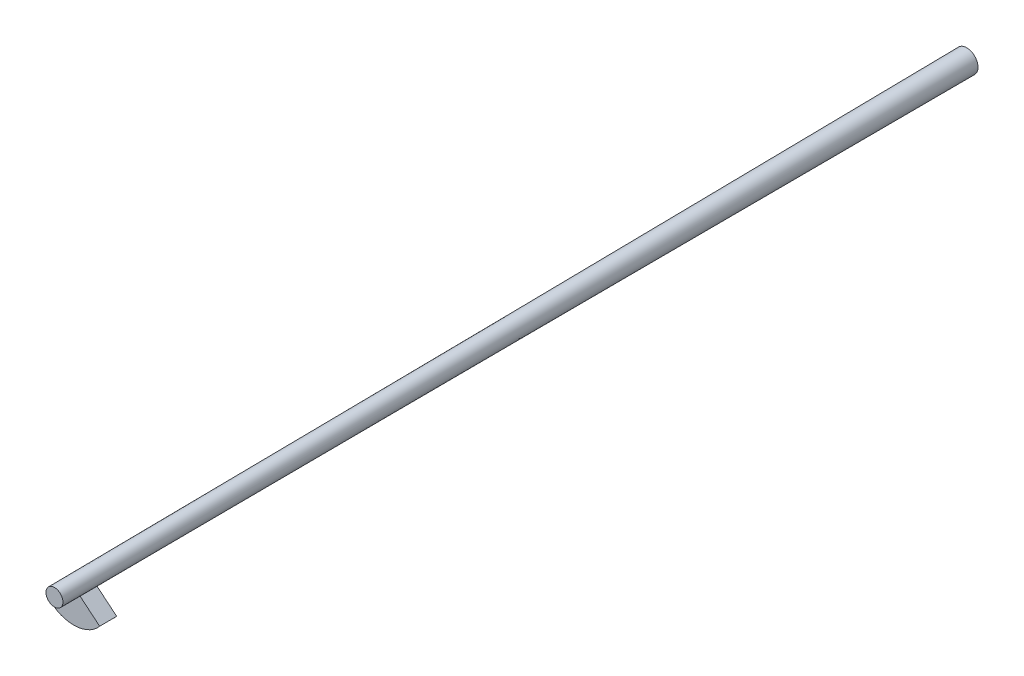
ISO-10303-21;
HEADER;
FILE_DESCRIPTION(('STEP AP214'),'2;1');
FILE_NAME('part.step','',(''),(''),'','','');
FILE_SCHEMA(('AUTOMOTIVE_DESIGN { 1 0 10303 214 1 1 1 1 }'));
ENDSEC;
DATA;
#1=APPLICATION_CONTEXT('core data for automotive mechanical design processes');
#2=APPLICATION_PROTOCOL_DEFINITION('international standard','automotive_design',2000,#1);
#3=PRODUCT_CONTEXT('',#1,'mechanical');
#4=PRODUCT('Part','Part','',(#3));
#5=PRODUCT_RELATED_PRODUCT_CATEGORY('part','',(#4));
#6=PRODUCT_DEFINITION_FORMATION('','',#4);
#7=PRODUCT_DEFINITION_CONTEXT('part definition',#1,'design');
#8=PRODUCT_DEFINITION('design','',#6,#7);
#9=PRODUCT_DEFINITION_SHAPE('','',#8);
#10=(LENGTH_UNIT() NAMED_UNIT(*) SI_UNIT(.MILLI.,.METRE.));
#11=(NAMED_UNIT(*) PLANE_ANGLE_UNIT() SI_UNIT($,.RADIAN.));
#12=(NAMED_UNIT(*) SI_UNIT($,.STERADIAN.) SOLID_ANGLE_UNIT());
#13=UNCERTAINTY_MEASURE_WITH_UNIT(LENGTH_MEASURE(1.E-05),#10,'distance_accuracy_value','');
#14=(GEOMETRIC_REPRESENTATION_CONTEXT(3) GLOBAL_UNCERTAINTY_ASSIGNED_CONTEXT((#13)) GLOBAL_UNIT_ASSIGNED_CONTEXT((#10,
#11,#12)) REPRESENTATION_CONTEXT('',''));
#15=CARTESIAN_POINT('',(0.,0.,0.));
#16=DIRECTION('',(0.,0.,1.));
#17=DIRECTION('',(1.,0.,0.));
#18=AXIS2_PLACEMENT_3D('',#15,#16,#17);
#19=CARTESIAN_POINT('',(0.,3.02083498303412,105.299405924511));
#20=DIRECTION('',(0.,-0.00929846353313626,0.999956768353474));
#21=DIRECTION('',(0.,-0.999956768353474,-0.00929846353313626));
#22=AXIS2_PLACEMENT_3D('',#19,#20,#21);
#23=CONICAL_SURFACE('',#22,1.00686074353616,1.56772788856533);
#24=CARTESIAN_POINT('',(0.,3.02083498303412,105.299405924511));
#25=DIRECTION('',(0.,0.00929846353313626,-0.999956768353474));
#26=DIRECTION('',(0.,0.999956768353474,0.00929846353313626));
#27=AXIS2_PLACEMENT_3D('',#24,#25,#26);
#28=CIRCLE('',#27,1.00686074353616);
#29=CARTESIAN_POINT('',(0.771300077580519,2.37366535182763,105.29338798113));
#30=VERTEX_POINT('',#29);
#31=CARTESIAN_POINT('',(-0.771300077580519,2.37366535182763,105.29338798113));
#32=VERTEX_POINT('',#31);
#33=EDGE_CURVE('E13',#30,#32,#28,.T.);
#34=ORIENTED_EDGE('',*,*,#33,.T.);
#35=DIRECTION('',(-0.766040836847642,-0.642785326745884,-0.00290860824977838));
#36=VECTOR('',#35,1.);
#37=CARTESIAN_POINT('',(-3.06946718952518,0.445271946526975,105.284661987032));
#38=LINE('',#37,#36);
#39=CARTESIAN_POINT('',(-3.06946718952518,0.445271946526975,105.284661987032));
#40=VERTEX_POINT('',#39);
#41=EDGE_CURVE('E117',#32,#40,#38,.T.);
#42=ORIENTED_EDGE('',*,*,#41,.T.);
#43=CARTESIAN_POINT('',(0.,3.02074938622428,105.308611005441));
#44=DIRECTION('',(0.,0.00929846353313626,-0.999956768353474));
#45=DIRECTION('',(0.,0.999956768353474,0.00929846353313626));
#46=AXIS2_PLACEMENT_3D('',#43,#44,#45);
#47=CIRCLE('',#46,4.00690484357242);
#48=CARTESIAN_POINT('',(3.06946718952518,0.445271946526976,105.284661987032));
#49=VERTEX_POINT('',#48);
#50=EDGE_CURVE('E99',#49,#40,#47,.T.);
#51=ORIENTED_EDGE('',*,*,#50,.F.);
#52=DIRECTION('',(0.766040836847642,-0.642785326745884,-0.00290860824977838));
#53=VECTOR('',#52,1.);
#54=CARTESIAN_POINT('',(3.06946718952518,0.445271946526976,105.284661987032));
#55=LINE('',#54,#53);
#56=EDGE_CURVE('E125',#30,#49,#55,.T.);
#57=ORIENTED_EDGE('',*,*,#56,.F.);
#58=EDGE_LOOP('',(#34,#42,#51,#57));
#59=FACE_BOUND('',#58,.T.);
#60=ADVANCED_FACE('F59',(#59),#23,.F.);
#61=CARTESIAN_POINT('',(0.,3.03943182255251,103.299501802703));
#62=DIRECTION('',(0.,0.00929846353313626,-0.999956768353474));
#63=DIRECTION('',(0.,0.999956768353474,0.00929846353313626));
#64=AXIS2_PLACEMENT_3D('',#61,#62,#63);
#65=CONICAL_SURFACE('',#64,1.01299761036521,0.0030684382295755);
#66=CARTESIAN_POINT('',(0.,3.03943182255251,103.299501802703));
#67=DIRECTION('',(0.,0.00929846353313626,-0.999956768353474));
#68=DIRECTION('',(0.,0.999956768353474,0.00929846353313626));
#69=AXIS2_PLACEMENT_3D('',#66,#67,#68);
#70=CIRCLE('',#69,1.01299761036521);
#71=CARTESIAN_POINT('',(0.776001190313077,2.38831765992198,103.293447179654));
#72=VERTEX_POINT('',#71);
#73=CARTESIAN_POINT('',(-0.776001190313077,2.38831765992198,103.293447179654));
#74=VERTEX_POINT('',#73);
#75=EDGE_CURVE('E67',#72,#74,#70,.T.);
#76=ORIENTED_EDGE('',*,*,#75,.T.);
#77=DIRECTION('',(0.0023505563662789,-0.0073261540471719,0.999970400737765));
#78=VECTOR('',#77,1.);
#79=CARTESIAN_POINT('',(-0.771300077580519,2.37366535182763,105.29338798113));
#80=LINE('',#79,#78);
#81=EDGE_CURVE('E123',#74,#32,#80,.T.);
#82=ORIENTED_EDGE('',*,*,#81,.T.);
#83=ORIENTED_EDGE('',*,*,#33,.F.);
#84=DIRECTION('',(-0.0023505563662789,-0.0073261540471719,0.999970400737765));
#85=VECTOR('',#84,1.);
#86=CARTESIAN_POINT('',(0.771300077580519,2.37366535182763,105.29338798113));
#87=LINE('',#86,#85);
#88=EDGE_CURVE('E111',#72,#30,#87,.T.);
#89=ORIENTED_EDGE('',*,*,#88,.F.);
#90=EDGE_LOOP('',(#76,#82,#83,#89));
#91=FACE_BOUND('',#90,.T.);
#92=ADVANCED_FACE('F61',(#91),#65,.F.);
#93=CARTESIAN_POINT('',(0.,3.03934622574268,103.308706883633));
#94=DIRECTION('',(0.,-0.00929846353313626,0.999956768353474));
#95=DIRECTION('',(0.,-0.999956768353474,-0.00929846353313626));
#96=AXIS2_PLACEMENT_3D('',#93,#94,#95);
#97=CONICAL_SURFACE('',#96,4.01304171040147,1.56772788856532);
#98=CARTESIAN_POINT('',(0.,3.03934622574268,103.308706883633));
#99=DIRECTION('',(0.,0.00929846353313626,-0.999956768353474));
#100=DIRECTION('',(0.,0.999956768353474,0.00929846353313626));
#101=AXIS2_PLACEMENT_3D('',#98,#99,#100);
#102=CIRCLE('',#101,4.01304171040147);
#103=CARTESIAN_POINT('',(3.07416830225773,0.459924254621319,103.284721185556));
#104=VERTEX_POINT('',#103);
#105=CARTESIAN_POINT('',(-3.07416830225773,0.459924254621319,103.284721185556));
#106=VERTEX_POINT('',#105);
#107=EDGE_CURVE('E110',#104,#106,#102,.T.);
#108=ORIENTED_EDGE('',*,*,#107,.T.);
#109=DIRECTION('',(0.766040836847642,0.642785326745884,0.00290860824977838));
#110=VECTOR('',#109,1.);
#111=CARTESIAN_POINT('',(-0.776001190313077,2.38831765992198,103.293447179654));
#112=LINE('',#111,#110);
#113=EDGE_CURVE('E118',#106,#74,#112,.T.);
#114=ORIENTED_EDGE('',*,*,#113,.T.);
#115=ORIENTED_EDGE('',*,*,#75,.F.);
#116=DIRECTION('',(-0.766040836847642,0.642785326745884,0.00290860824977838));
#117=VECTOR('',#116,1.);
#118=CARTESIAN_POINT('',(0.776001190313077,2.38831765992198,103.293447179654));
#119=LINE('',#118,#117);
#120=EDGE_CURVE('E128',#104,#72,#119,.T.);
#121=ORIENTED_EDGE('',*,*,#120,.F.);
#122=EDGE_LOOP('',(#108,#114,#115,#121));
#123=FACE_BOUND('',#122,.T.);
#124=ADVANCED_FACE('F131',(#123),#97,.T.);
#125=CARTESIAN_POINT('',(0.,3.02074938622428,105.308611005441));
#126=DIRECTION('',(0.,0.00929846353313626,-0.999956768353474));
#127=DIRECTION('',(0.,0.999956768353474,0.00929846353313626));
#128=AXIS2_PLACEMENT_3D('',#125,#126,#127);
#129=CONICAL_SURFACE('',#128,4.00690484357242,0.003068438229576);
#130=DIRECTION('',(0.0023505563662789,0.0073261540471719,-0.999970400737765));
#131=VECTOR('',#130,1.);
#132=CARTESIAN_POINT('',(3.07416830225773,0.459924254621319,103.284721185556));
#133=LINE('',#132,#131);
#134=EDGE_CURVE('E105',#49,#104,#133,.T.);
#135=ORIENTED_EDGE('',*,*,#134,.F.);
#136=ORIENTED_EDGE('',*,*,#50,.T.);
#137=DIRECTION('',(-0.0023505563662789,0.0073261540471719,-0.999970400737765));
#138=VECTOR('',#137,1.);
#139=CARTESIAN_POINT('',(-3.07416830225773,0.459924254621319,103.284721185556));
#140=LINE('',#139,#138);
#141=EDGE_CURVE('E102',#40,#106,#140,.T.);
#142=ORIENTED_EDGE('',*,*,#141,.T.);
#143=ORIENTED_EDGE('',*,*,#107,.F.);
#144=EDGE_LOOP('',(#135,#136,#142,#143));
#145=FACE_BOUND('',#144,.T.);
#146=ADVANCED_FACE('F101',(#145),#129,.T.);
#147=CARTESIAN_POINT('',(3.06404530302556,1.42872602088599,0.0132855311594383));
#148=DIRECTION('',(-0.642787609686538,-0.766011325756391,-0.0071230363191035));
#149=DIRECTION('',(-0.0071230363191035,-0.00332138278985956,0.999969114908036));
#150=AXIS2_PLACEMENT_3D('',#147,#148,#149);
#151=PLANE('',#150);
#152=ORIENTED_EDGE('',*,*,#56,.T.);
#153=ORIENTED_EDGE('',*,*,#134,.T.);
#154=ORIENTED_EDGE('',*,*,#120,.T.);
#155=ORIENTED_EDGE('',*,*,#88,.T.);
#156=EDGE_LOOP('',(#152,#153,#154,#155));
#157=FACE_BOUND('',#156,.T.);
#158=ADVANCED_FACE('F133',(#157),#151,.F.);
#159=CARTESIAN_POINT('',(-3.06404530302556,1.42872602088599,0.0132855311594383));
#160=DIRECTION('',(-0.642787609686538,0.766011325756391,0.00712303631910351));
#161=DIRECTION('',(0.00712303631910351,-0.00332138278985957,0.999969114908036));
#162=AXIS2_PLACEMENT_3D('',#159,#160,#161);
#163=PLANE('',#162);
#164=ORIENTED_EDGE('',*,*,#41,.F.);
#165=ORIENTED_EDGE('',*,*,#81,.F.);
#166=ORIENTED_EDGE('',*,*,#113,.F.);
#167=ORIENTED_EDGE('',*,*,#141,.F.);
#168=EDGE_LOOP('',(#164,#165,#166,#167));
#169=FACE_BOUND('',#168,.T.);
#170=ADVANCED_FACE('F115',(#169),#163,.T.);
#171=CLOSED_SHELL('',(#60,#92,#124,#146,#158,#170));
#172=MANIFOLD_SOLID_BREP('B2',#171);
#173=CARTESIAN_POINT('',(0.,4.,0.));
#174=DIRECTION('',(0.,0.,1.));
#175=DIRECTION('',(1.,0.,0.));
#176=AXIS2_PLACEMENT_3D('',#173,#174,#175);
#177=PLANE('',#176);
#178=CARTESIAN_POINT('',(0.,4.,0.));
#179=DIRECTION('',(0.,0.,1.));
#180=DIRECTION('',(1.,0.,0.));
#181=AXIS2_PLACEMENT_3D('',#178,#179,#180);
#182=CIRCLE('',#181,1.33);
#183=CARTESIAN_POINT('',(-1.25775116185321,3.56760895608615,0.));
#184=VERTEX_POINT('',#183);
#185=EDGE_CURVE('E58',#184,#184,#182,.T.);
#186=ORIENTED_EDGE('',*,*,#185,.F.);
#187=EDGE_LOOP('',(#186));
#188=FACE_BOUND('',#187,.T.);
#189=ADVANCED_FACE('F195',(#188),#177,.F.);
#190=CARTESIAN_POINT('',(0.,3.,107.54));
#191=DIRECTION('',(0.,0.,1.));
#192=DIRECTION('',(1.,0.,0.));
#193=AXIS2_PLACEMENT_3D('',#190,#191,#192);
#194=PLANE('',#193);
#195=CARTESIAN_POINT('',(0.,3.,107.54));
#196=DIRECTION('',(0.,0.,1.));
#197=DIRECTION('',(1.,0.,0.));
#198=AXIS2_PLACEMENT_3D('',#195,#196,#197);
#199=CIRCLE('',#198,1.);
#200=CARTESIAN_POINT('',(-0.630133871185369,2.22351348731292,107.54));
#201=VERTEX_POINT('',#200);
#202=EDGE_CURVE('E203',#201,#201,#199,.T.);
#203=ORIENTED_EDGE('',*,*,#202,.T.);
#204=EDGE_LOOP('',(#203));
#205=FACE_BOUND('',#204,.T.);
#206=ADVANCED_FACE('F227',(#205),#194,.T.);
#207=CARTESIAN_POINT('',(-0.630133871185369,2.22351348731292,107.54));
#208=CARTESIAN_POINT('',(-1.25775116185321,3.56760895608615,0.));
#209=CARTESIAN_POINT('',(-0.694841080575959,2.27602464324504,107.54));
#210=CARTESIAN_POINT('',(-1.29378374884603,3.67242155290725,0.));
#211=CARTESIAN_POINT('',(-0.76165251927725,2.34329365949734,107.54));
#212=CARTESIAN_POINT('',(-1.32179859947886,3.79536712500961,0.));
#213=CARTESIAN_POINT('',(-0.883036960503424,2.51872720400728,107.54));
#214=CARTESIAN_POINT('',(-1.33522261587105,4.0787827213136,0.));
#215=CARTESIAN_POINT('',(-0.937584486235418,2.62755791195349,107.54));
#216=CARTESIAN_POINT('',(-1.32013393742832,4.23998645453673,0.));
#217=CARTESIAN_POINT('',(-1.00241352288567,2.88622431316963,107.54));
#218=CARTESIAN_POINT('',(-1.21113717423343,4.57748926942496,0.));
#219=CARTESIAN_POINT('',(-1.01156600851155,3.03660780277067,107.54));
#220=CARTESIAN_POINT('',(-1.11556947548108,4.75361141092571,0.));
#221=CARTESIAN_POINT('',(-0.951771480875403,3.34458231090979,107.54));
#222=CARTESIAN_POINT('',(-0.831239342581664,5.0589931863081,0.));
#223=CARTESIAN_POINT('',(-0.881508824551307,3.50071945240419,107.54));
#224=CARTESIAN_POINT('',(-0.642016237556048,5.18568598786757,0.));
#225=CARTESIAN_POINT('',(-0.67146420082285,3.75954828996655,107.54));
#226=CARTESIAN_POINT('',(-0.222765850271646,5.32981633583885,0.));
#227=CARTESIAN_POINT('',(-0.533135829430452,3.8604487830064,107.54));
#228=CARTESIAN_POINT('',(0.00436004522392653,5.34625644039619,0.));
#229=CARTESIAN_POINT('',(-0.24406731419581,3.98236300161444,107.54));
#230=CARTESIAN_POINT('',(0.416362735495832,5.28026071008721,0.));
#231=CARTESIAN_POINT('',(-0.0950207483787361,4.00436489143902,107.54));
#232=CARTESIAN_POINT('',(0.600024498835191,5.2001323726609,0.));
#233=CARTESIAN_POINT('',(0.171451127050833,3.99417417428274,107.54));
#234=CARTESIAN_POINT('',(0.893508107433325,5.0009946918251,0.));
#235=CARTESIAN_POINT('',(0.289180075600346,3.96319918067529,107.54));
#236=CARTESIAN_POINT('',(1.00452994548574,4.88314536727173,0.));
#237=CARTESIAN_POINT('',(0.485844509970799,3.88052989154771,107.54));
#238=CARTESIAN_POINT('',(1.16821330068066,4.65138608768065,0.));
#239=CARTESIAN_POINT('',(0.565426661794779,3.82899766861919,107.54));
#240=CARTESIAN_POINT('',(1.22171857486039,4.53720364073495,0.));
#241=CARTESIAN_POINT('',(0.694841080575959,3.72397535675496,107.54));
#242=CARTESIAN_POINT('',(1.29378374884603,4.32757844709275,0.));
#243=CARTESIAN_POINT('',(0.76165251927725,3.65670634050266,107.54));
#244=CARTESIAN_POINT('',(1.32179859947886,4.20463287499039,0.));
#245=CARTESIAN_POINT('',(0.883036960503424,3.48127279599272,107.54));
#246=CARTESIAN_POINT('',(1.33522261587105,3.9212172786864,0.));
#247=CARTESIAN_POINT('',(0.937584486235417,3.37244208804651,107.54));
#248=CARTESIAN_POINT('',(1.32013393742832,3.76001354546327,0.));
#249=CARTESIAN_POINT('',(1.00241352288567,3.11377568683037,107.54));
#250=CARTESIAN_POINT('',(1.21113717423343,3.42251073057504,0.));
#251=CARTESIAN_POINT('',(1.01156600851155,2.96339219722934,107.54));
#252=CARTESIAN_POINT('',(1.11556947548108,3.24638858907429,0.));
#253=CARTESIAN_POINT('',(0.951771480875403,2.6554176890902,107.54));
#254=CARTESIAN_POINT('',(0.831239342581664,2.9410068136919,0.));
#255=CARTESIAN_POINT('',(0.881508824551307,2.49928054759581,107.54));
#256=CARTESIAN_POINT('',(0.642016237556048,2.81431401213243,0.));
#257=CARTESIAN_POINT('',(0.67146420082285,2.24045171003345,107.54));
#258=CARTESIAN_POINT('',(0.222765850271645,2.67018366416115,0.));
#259=CARTESIAN_POINT('',(0.533135829430452,2.1395512169936,107.54));
#260=CARTESIAN_POINT('',(-0.00436004522392754,2.65374355960381,0.));
#261=CARTESIAN_POINT('',(0.24406731419581,2.01763699838556,107.54));
#262=CARTESIAN_POINT('',(-0.416362735495833,2.71973928991279,0.));
#263=CARTESIAN_POINT('',(0.0950207483787373,1.99563510856098,107.54));
#264=CARTESIAN_POINT('',(-0.600024498835191,2.7998676273391,0.));
#265=CARTESIAN_POINT('',(-0.171451127050832,2.00582582571726,107.54));
#266=CARTESIAN_POINT('',(-0.893508107433325,2.9990053081749,0.));
#267=CARTESIAN_POINT('',(-0.289180075600345,2.03680081932471,107.54));
#268=CARTESIAN_POINT('',(-1.00452994548574,3.11685463272827,0.));
#269=CARTESIAN_POINT('',(-0.485844509970798,2.1194701084523,107.54));
#270=CARTESIAN_POINT('',(-1.16821330068066,3.34861391231935,0.));
#271=CARTESIAN_POINT('',(-0.56542666179478,2.17100233138081,107.54));
#272=CARTESIAN_POINT('',(-1.22171857486039,3.46279635926505,0.));
#273=CARTESIAN_POINT('',(-0.630133871185369,2.22351348731292,107.54));
#274=CARTESIAN_POINT('',(-1.25775116185321,3.56760895608615,0.));
#275=B_SPLINE_SURFACE_WITH_KNOTS('',3,1,((#207,#208),(#209,#210),(#211,#212),(#213,#214),(#215,
#216),(#217,#218),(#219,#220),(#221,#222),(#223,#224),(#225,#226),(#227,#228),(#229,#230),(#231,
#232),(#233,#234),(#235,#236),(#237,#238),(#239,#240),(#241,#242),(#243,#244),(#245,#246),(#247,
#248),(#249,#250),(#251,#252),(#253,#254),(#255,#256),(#257,#258),(#259,#260),(#261,#262),(#263,
#264),(#265,#266),(#267,#268),(#269,#270),(#271,#272),(#273,#274)),.UNSPECIFIED.,.T.,.F.,.F.,(4,
2,2,2,2,2,2,2,2,2,2,2,2,2,2,2,4),(2,2),(0.,0.0625000000000002,0.125,0.1875,0.250000000000001,
0.312500000000001,0.375000000000001,0.4375,0.5,0.5625,0.625,0.6875,0.75,0.8125,0.875,0.9375,1.),
(0.,1.),.UNSPECIFIED.);
#276=CARTESIAN_POINT('',(-0.630133871185369,2.22351348731292,107.54));
#277=CARTESIAN_POINT('',(-0.636671551296493,2.23751448177931,106.419791666667));
#278=CARTESIAN_POINT('',(-0.643209231407616,2.2515154762457,105.299583333333));
#279=CARTESIAN_POINT('',(-0.656284591629863,2.27951746517847,103.059166666667));
#280=CARTESIAN_POINT('',(-0.662822271740986,2.29351845964486,101.938958333333));
#281=CARTESIAN_POINT('',(-0.675897631963233,2.32152044857764,99.6985416666667));
#282=CARTESIAN_POINT('',(-0.682435312074356,2.33552144304402,98.5783333333333));
#283=CARTESIAN_POINT('',(-0.695510672296603,2.3635234319768,96.3379166666667));
#284=CARTESIAN_POINT('',(-0.702048352407726,2.37752442644319,95.2177083333333));
#285=CARTESIAN_POINT('',(-0.715123712629973,2.40552641537596,92.9772916666667));
#286=CARTESIAN_POINT('',(-0.721661392741096,2.41952740984235,91.8570833333333));
#287=CARTESIAN_POINT('',(-0.734736752963342,2.44752939877513,89.6166666666667));
#288=CARTESIAN_POINT('',(-0.741274433074466,2.46153039324151,88.4964583333333));
#289=CARTESIAN_POINT('',(-0.754349793296712,2.48953238217429,86.2560416666667));
#290=CARTESIAN_POINT('',(-0.760887473407836,2.50353337664068,85.1358333333333));
#291=CARTESIAN_POINT('',(-0.773962833630082,2.53153536557345,82.8954166666667));
#292=CARTESIAN_POINT('',(-0.780500513741206,2.54553636003984,81.7752083333333));
#293=CARTESIAN_POINT('',(-0.793575873963452,2.57353834897262,79.5347916666667));
#294=CARTESIAN_POINT('',(-0.800113554074576,2.58753934343901,78.4145833333333));
#295=CARTESIAN_POINT('',(-0.813188914296822,2.61554133237178,76.1741666666667));
#296=CARTESIAN_POINT('',(-0.819726594407945,2.62954232683817,75.0539583333333));
#297=CARTESIAN_POINT('',(-0.832801954630192,2.65754431577094,72.8135416666667));
#298=CARTESIAN_POINT('',(-0.839339634741315,2.67154531023733,71.6933333333333));
#299=CARTESIAN_POINT('',(-0.852414994963562,2.69954729917011,69.4529166666667));
#300=CARTESIAN_POINT('',(-0.858952675074685,2.7135482936365,68.3327083333333));
#301=CARTESIAN_POINT('',(-0.872028035296932,2.74155028256927,66.0922916666667));
#302=CARTESIAN_POINT('',(-0.878565715408055,2.75555127703566,64.9720833333333));
#303=CARTESIAN_POINT('',(-0.891641075630302,2.78355326596843,62.7316666666667));
#304=CARTESIAN_POINT('',(-0.898178755741425,2.79755426043482,61.6114583333333));
#305=CARTESIAN_POINT('',(-0.911254115963672,2.8255562493676,59.3710416666667));
#306=CARTESIAN_POINT('',(-0.917791796074795,2.83955724383399,58.2508333333333));
#307=CARTESIAN_POINT('',(-0.930867156297042,2.86755923276676,56.0104166666667));
#308=CARTESIAN_POINT('',(-0.937404836408165,2.88156022723315,54.8902083333333));
#309=CARTESIAN_POINT('',(-0.950480196630412,2.90956221616593,52.6497916666667));
#310=CARTESIAN_POINT('',(-0.957017876741535,2.92356321063231,51.5295833333333));
#311=CARTESIAN_POINT('',(-0.970093236963781,2.95156519956509,49.2891666666667));
#312=CARTESIAN_POINT('',(-0.976630917074905,2.96556619403148,48.1689583333333));
#313=CARTESIAN_POINT('',(-0.989706277297151,2.99356818296425,45.9285416666667));
#314=CARTESIAN_POINT('',(-0.996243957408275,3.00756917743064,44.8083333333333));
#315=CARTESIAN_POINT('',(-1.00931931763052,3.03557116636342,42.5679166666667));
#316=CARTESIAN_POINT('',(-1.01585699774164,3.0495721608298,41.4477083333333));
#317=CARTESIAN_POINT('',(-1.02893235796389,3.07757414976258,39.2072916666667));
#318=CARTESIAN_POINT('',(-1.03547003807501,3.09157514422897,38.0870833333333));
#319=CARTESIAN_POINT('',(-1.04854539829726,3.11957713316174,35.8466666666667));
#320=CARTESIAN_POINT('',(-1.05508307840838,3.13357812762813,34.7264583333333));
#321=CARTESIAN_POINT('',(-1.06815843863063,3.16158011656091,32.4860416666667));
#322=CARTESIAN_POINT('',(-1.07469611874175,3.17558111102729,31.3658333333333));
#323=CARTESIAN_POINT('',(-1.087771478964,3.20358309996007,29.1254166666667));
#324=CARTESIAN_POINT('',(-1.09430915907512,3.21758409442646,28.0052083333333));
#325=CARTESIAN_POINT('',(-1.10738451929737,3.24558608335923,25.7647916666667));
#326=CARTESIAN_POINT('',(-1.11392219940849,3.25958707782562,24.6445833333333));
#327=CARTESIAN_POINT('',(-1.12699755963074,3.2875890667584,22.4041666666667));
#328=CARTESIAN_POINT('',(-1.13353523974186,3.30159006122478,21.2839583333333));
#329=CARTESIAN_POINT('',(-1.14661059996411,3.32959205015756,19.0435416666667));
#330=CARTESIAN_POINT('',(-1.15314828007523,3.34359304462395,17.9233333333333));
#331=CARTESIAN_POINT('',(-1.16622364029748,3.37159503355672,15.6829166666667));
#332=CARTESIAN_POINT('',(-1.1727613204086,3.38559602802311,14.5627083333333));
#333=CARTESIAN_POINT('',(-1.18583668063085,3.41359801695589,12.3222916666667));
#334=CARTESIAN_POINT('',(-1.19237436074197,3.42759901142228,11.2020833333333));
#335=CARTESIAN_POINT('',(-1.20544972096422,3.45560100035505,8.96166666666667));
#336=CARTESIAN_POINT('',(-1.21198740107534,3.46960199482144,7.84145833333333));
#337=CARTESIAN_POINT('',(-1.22506276129759,3.49760398375421,5.60104166666667));
#338=CARTESIAN_POINT('',(-1.23160044140871,3.5116049782206,4.48083333333333));
#339=CARTESIAN_POINT('',(-1.24467580163096,3.53960696715338,2.24041666666667));
#340=CARTESIAN_POINT('',(-1.25121348174208,3.55360796161977,1.12020833333333));
#341=CARTESIAN_POINT('',(-1.25775116185321,3.56760895608615,0.));
#342=B_SPLINE_CURVE_WITH_KNOTS('',3,(#276,#277,#278,#279,#280,#281,#282,#283,#284,#285,#286,
#287,#288,#289,#290,#291,#292,#293,#294,#295,#296,#297,#298,#299,#300,#301,#302,#303,#304,#305,
#306,#307,#308,#309,#310,#311,#312,#313,#314,#315,#316,#317,#318,#319,#320,#321,#322,#323,#324,
#325,#326,#327,#328,#329,#330,#331,#332,#333,#334,#335,#336,#337,#338,#339,#340,#341),
.UNSPECIFIED.,.F.,.F.,(4,2,2,2,2,2,2,2,2,2,2,2,2,2,2,2,2,2,2,2,2,2,2,2,2,2,2,2,2,2,2,2,4),(0.,
3.36094470537535,6.72188941075068,10.082834116126,13.4437788215014,16.8047235268767,
20.1656682322521,23.5266129376274,26.8875576430027,30.2485023483781,33.6094470537534,
36.9703917591288,40.3313364645041,43.6922811698794,47.0532258752548,50.4141705806301,
53.7751152860055,57.1360599913808,60.4970046967561,63.8579494021315,67.2188941075068,
70.5798388128822,73.9407835182575,77.3017282236329,80.6626729290082,84.0236176343836,
87.3845623397589,90.7455070451342,94.1064517505096,97.4673964558849,100.82834116126,
104.189285866636,107.550230572011),.UNSPECIFIED.);
#343=EDGE_CURVE('BSEAM235',#201,#184,#342,.T.);
#344=ORIENTED_EDGE('',*,*,#202,.F.);
#345=ORIENTED_EDGE('',*,*,#185,.T.);
#346=ORIENTED_EDGE('',*,*,#343,.T.);
#347=ORIENTED_EDGE('',*,*,#343,.F.);
#348=EDGE_LOOP('',(#344,#346,#345,#347));
#349=FACE_BOUND('',#348,.T.);
#350=ADVANCED_FACE('F235',(#349),#275,.T.);
#351=CLOSED_SHELL('',(#189,#206,#350));
#352=MANIFOLD_SOLID_BREP('B7',#351);
#353=ADVANCED_BREP_SHAPE_REPRESENTATION('',(#18,#172,#352),#14);
#354=SHAPE_DEFINITION_REPRESENTATION(#9,#353);
ENDSEC;
END-ISO-10303-21;
